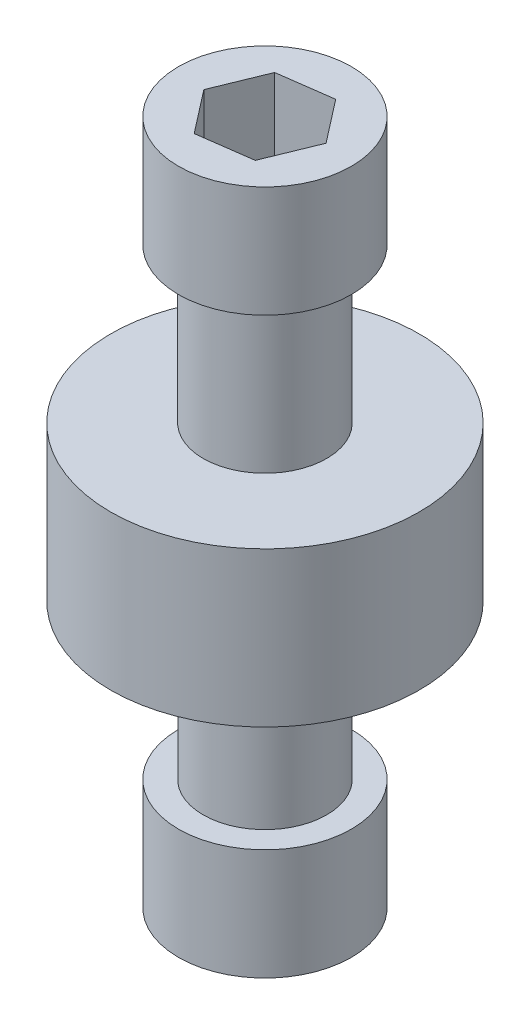
ISO-10303-21;
HEADER;
FILE_DESCRIPTION(('STEP AP214'),'2;1');
FILE_NAME('part.step','',(''),(''),'','','');
FILE_SCHEMA(('AUTOMOTIVE_DESIGN { 1 0 10303 214 1 1 1 1 }'));
ENDSEC;
DATA;
#1=APPLICATION_CONTEXT('core data for automotive mechanical design processes');
#2=APPLICATION_PROTOCOL_DEFINITION('international standard','automotive_design',2000,#1);
#3=PRODUCT_CONTEXT('',#1,'mechanical');
#4=PRODUCT('Part','Part','',(#3));
#5=PRODUCT_RELATED_PRODUCT_CATEGORY('part','',(#4));
#6=PRODUCT_DEFINITION_FORMATION('','',#4);
#7=PRODUCT_DEFINITION_CONTEXT('part definition',#1,'design');
#8=PRODUCT_DEFINITION('design','',#6,#7);
#9=PRODUCT_DEFINITION_SHAPE('','',#8);
#10=(LENGTH_UNIT() NAMED_UNIT(*) SI_UNIT(.MILLI.,.METRE.));
#11=(NAMED_UNIT(*) PLANE_ANGLE_UNIT() SI_UNIT($,.RADIAN.));
#12=(NAMED_UNIT(*) SI_UNIT($,.STERADIAN.) SOLID_ANGLE_UNIT());
#13=UNCERTAINTY_MEASURE_WITH_UNIT(LENGTH_MEASURE(1.E-05),#10,'distance_accuracy_value','');
#14=(GEOMETRIC_REPRESENTATION_CONTEXT(3) GLOBAL_UNCERTAINTY_ASSIGNED_CONTEXT((#13)) GLOBAL_UNIT_ASSIGNED_CONTEXT((#10,
#11,#12)) REPRESENTATION_CONTEXT('',''));
#15=CARTESIAN_POINT('',(0.,0.,0.));
#16=DIRECTION('',(0.,0.,1.));
#17=DIRECTION('',(1.,0.,0.));
#18=AXIS2_PLACEMENT_3D('',#15,#16,#17);
#19=CARTESIAN_POINT('',(0.,-10.922,0.));
#20=DIRECTION('',(0.,-1.,0.));
#21=DIRECTION('',(0.,0.,1.));
#22=AXIS2_PLACEMENT_3D('',#19,#20,#21);
#23=PLANE('',#22);
#24=CARTESIAN_POINT('',(0.,-10.922,0.));
#25=DIRECTION('',(0.,1.,0.));
#26=DIRECTION('',(0.,0.,1.));
#27=AXIS2_PLACEMENT_3D('',#24,#25,#26);
#28=CIRCLE('',#27,3.556);
#29=CARTESIAN_POINT('',(0.,-10.922,3.556));
#30=VERTEX_POINT('',#29);
#31=EDGE_CURVE('E215',#30,#30,#28,.T.);
#32=ORIENTED_EDGE('',*,*,#31,.F.);
#33=EDGE_LOOP('',(#32));
#34=FACE_BOUND('',#33,.T.);
#35=DIRECTION('',(0.990813388488827,0.,-0.135236197784794));
#36=VECTOR('',#35,1.);
#37=CARTESIAN_POINT('',(-0.844747720357736,-10.922,2.06713158503077));
#38=LINE('',#37,#36);
#39=CARTESIAN_POINT('',(-0.844747720357736,-10.922,2.06713158503077));
#40=VERTEX_POINT('',#39);
#41=CARTESIAN_POINT('',(1.36781460542297,-10.922,1.76513877813418));
#42=VERTEX_POINT('',#41);
#43=EDGE_CURVE('E189',#40,#42,#38,.T.);
#44=ORIENTED_EDGE('',*,*,#43,.T.);
#45=DIRECTION('',(0.378288711451565,0.,-0.925687663733462));
#46=VECTOR('',#45,1.);
#47=CARTESIAN_POINT('',(1.36781460542297,-10.922,1.76513877813418));
#48=LINE('',#47,#46);
#49=CARTESIAN_POINT('',(2.21256232578071,-10.922,-0.301992806896592));
#50=VERTEX_POINT('',#49);
#51=EDGE_CURVE('E56',#42,#50,#48,.T.);
#52=ORIENTED_EDGE('',*,*,#51,.T.);
#53=DIRECTION('',(-0.612524677037262,0.,-0.790451465948667));
#54=VECTOR('',#53,1.);
#55=CARTESIAN_POINT('',(2.21256232578071,-10.922,-0.301992806896592));
#56=LINE('',#55,#54);
#57=CARTESIAN_POINT('',(0.844747720357737,-10.922,-2.06713158503077));
#58=VERTEX_POINT('',#57);
#59=EDGE_CURVE('E171',#50,#58,#56,.T.);
#60=ORIENTED_EDGE('',*,*,#59,.T.);
#61=DIRECTION('',(-0.990813388488827,0.,0.135236197784794));
#62=VECTOR('',#61,1.);
#63=CARTESIAN_POINT('',(0.844747720357737,-10.922,-2.06713158503077));
#64=LINE('',#63,#62);
#65=CARTESIAN_POINT('',(-1.36781460542297,-10.922,-1.76513877813418));
#66=VERTEX_POINT('',#65);
#67=EDGE_CURVE('E175',#58,#66,#64,.T.);
#68=ORIENTED_EDGE('',*,*,#67,.T.);
#69=DIRECTION('',(-0.378288711451565,0.,0.925687663733461));
#70=VECTOR('',#69,1.);
#71=CARTESIAN_POINT('',(-1.36781460542297,-10.922,-1.76513877813418));
#72=LINE('',#71,#70);
#73=CARTESIAN_POINT('',(-2.21256232578071,-10.922,0.301992806896591));
#74=VERTEX_POINT('',#73);
#75=EDGE_CURVE('E195',#66,#74,#72,.T.);
#76=ORIENTED_EDGE('',*,*,#75,.T.);
#77=DIRECTION('',(0.612524677037262,0.,0.790451465948668));
#78=VECTOR('',#77,1.);
#79=CARTESIAN_POINT('',(-2.21256232578071,-10.922,0.301992806896591));
#80=LINE('',#79,#78);
#81=EDGE_CURVE('E192',#74,#40,#80,.T.);
#82=ORIENTED_EDGE('',*,*,#81,.T.);
#83=EDGE_LOOP('',(#44,#52,#60,#68,#76,#82));
#84=FACE_BOUND('',#83,.T.);
#85=ADVANCED_FACE('F38',(#34,#84),#23,.T.);
#86=CARTESIAN_POINT('',(0.,6.35,0.));
#87=DIRECTION('',(0.,-1.,0.));
#88=DIRECTION('',(0.,0.,-1.));
#89=AXIS2_PLACEMENT_3D('',#86,#87,#88);
#90=CYLINDRICAL_SURFACE('',#89,6.35);
#91=CARTESIAN_POINT('',(0.,6.35,0.));
#92=DIRECTION('',(0.,1.,0.));
#93=DIRECTION('',(0.,0.,1.));
#94=AXIS2_PLACEMENT_3D('',#91,#92,#93);
#95=CIRCLE('',#94,6.35);
#96=CARTESIAN_POINT('',(0.,6.35,6.35));
#97=VERTEX_POINT('',#96);
#98=EDGE_CURVE('E11',#97,#97,#95,.T.);
#99=ORIENTED_EDGE('',*,*,#98,.F.);
#100=EDGE_LOOP('',(#99));
#101=FACE_BOUND('',#100,.T.);
#102=CARTESIAN_POINT('',(0.,0.,0.));
#103=DIRECTION('',(0.,1.,0.));
#104=DIRECTION('',(0.,0.,1.));
#105=AXIS2_PLACEMENT_3D('',#102,#103,#104);
#106=CIRCLE('',#105,6.35);
#107=CARTESIAN_POINT('',(0.,0.,6.35));
#108=VERTEX_POINT('',#107);
#109=EDGE_CURVE('E42',#108,#108,#106,.T.);
#110=ORIENTED_EDGE('',*,*,#109,.T.);
#111=EDGE_LOOP('',(#110));
#112=FACE_BOUND('',#111,.T.);
#113=ADVANCED_FACE('F40',(#101,#112),#90,.T.);
#114=CARTESIAN_POINT('',(0.,6.35,0.));
#115=DIRECTION('',(0.,1.,0.));
#116=DIRECTION('',(0.,0.,1.));
#117=AXIS2_PLACEMENT_3D('',#114,#115,#116);
#118=PLANE('',#117);
#119=CARTESIAN_POINT('',(0.,6.35,0.));
#120=DIRECTION('',(0.,1.,0.));
#121=DIRECTION('',(0.,0.,1.));
#122=AXIS2_PLACEMENT_3D('',#119,#120,#121);
#123=CIRCLE('',#122,2.54);
#124=CARTESIAN_POINT('',(0.,6.35,2.54));
#125=VERTEX_POINT('',#124);
#126=EDGE_CURVE('E299',#125,#125,#123,.T.);
#127=ORIENTED_EDGE('',*,*,#126,.F.);
#128=EDGE_LOOP('',(#127));
#129=FACE_BOUND('',#128,.T.);
#130=ORIENTED_EDGE('',*,*,#98,.T.);
#131=EDGE_LOOP('',(#130));
#132=FACE_BOUND('',#131,.T.);
#133=ADVANCED_FACE('F313',(#129,#132),#118,.T.);
#134=CARTESIAN_POINT('',(0.,0.,0.));
#135=DIRECTION('',(0.,1.,0.));
#136=DIRECTION('',(0.,0.,1.));
#137=AXIS2_PLACEMENT_3D('',#134,#135,#136);
#138=PLANE('',#137);
#139=CARTESIAN_POINT('',(0.,0.,0.));
#140=DIRECTION('',(0.,1.,0.));
#141=DIRECTION('',(0.,0.,1.));
#142=AXIS2_PLACEMENT_3D('',#139,#140,#141);
#143=CIRCLE('',#142,2.54);
#144=CARTESIAN_POINT('',(0.,0.,2.54));
#145=VERTEX_POINT('',#144);
#146=EDGE_CURVE('E226',#145,#145,#143,.T.);
#147=ORIENTED_EDGE('',*,*,#146,.T.);
#148=EDGE_LOOP('',(#147));
#149=FACE_BOUND('',#148,.T.);
#150=ORIENTED_EDGE('',*,*,#109,.F.);
#151=EDGE_LOOP('',(#150));
#152=FACE_BOUND('',#151,.T.);
#153=ADVANCED_FACE('F316',(#149,#152),#138,.F.);
#154=CARTESIAN_POINT('',(0.,12.7,0.));
#155=DIRECTION('',(0.,-1.,0.));
#156=DIRECTION('',(0.,0.,-1.));
#157=AXIS2_PLACEMENT_3D('',#154,#155,#156);
#158=CYLINDRICAL_SURFACE('',#157,2.54);
#159=CARTESIAN_POINT('',(0.,12.7,0.));
#160=DIRECTION('',(0.,1.,0.));
#161=DIRECTION('',(0.,0.,1.));
#162=AXIS2_PLACEMENT_3D('',#159,#160,#161);
#163=CIRCLE('',#162,2.54);
#164=CARTESIAN_POINT('',(0.,12.7,2.54));
#165=VERTEX_POINT('',#164);
#166=EDGE_CURVE('E303',#165,#165,#163,.T.);
#167=ORIENTED_EDGE('',*,*,#166,.F.);
#168=EDGE_LOOP('',(#167));
#169=FACE_BOUND('',#168,.T.);
#170=ORIENTED_EDGE('',*,*,#126,.T.);
#171=EDGE_LOOP('',(#170));
#172=FACE_BOUND('',#171,.T.);
#173=ADVANCED_FACE('F311',(#169,#172),#158,.T.);
#174=CARTESIAN_POINT('',(0.,17.272,0.));
#175=DIRECTION('',(0.,-1.,0.));
#176=DIRECTION('',(0.,0.,-1.));
#177=AXIS2_PLACEMENT_3D('',#174,#175,#176);
#178=CYLINDRICAL_SURFACE('',#177,3.556);
#179=CARTESIAN_POINT('',(0.,17.272,0.));
#180=DIRECTION('',(0.,1.,0.));
#181=DIRECTION('',(0.,0.,1.));
#182=AXIS2_PLACEMENT_3D('',#179,#180,#181);
#183=CIRCLE('',#182,3.556);
#184=CARTESIAN_POINT('',(0.,17.272,3.556));
#185=VERTEX_POINT('',#184);
#186=EDGE_CURVE('E295',#185,#185,#183,.T.);
#187=ORIENTED_EDGE('',*,*,#186,.F.);
#188=EDGE_LOOP('',(#187));
#189=FACE_BOUND('',#188,.T.);
#190=CARTESIAN_POINT('',(0.,12.7,0.));
#191=DIRECTION('',(0.,1.,0.));
#192=DIRECTION('',(0.,0.,1.));
#193=AXIS2_PLACEMENT_3D('',#190,#191,#192);
#194=CIRCLE('',#193,3.556);
#195=CARTESIAN_POINT('',(0.,12.7,3.556));
#196=VERTEX_POINT('',#195);
#197=EDGE_CURVE('E280',#196,#196,#194,.T.);
#198=ORIENTED_EDGE('',*,*,#197,.T.);
#199=EDGE_LOOP('',(#198));
#200=FACE_BOUND('',#199,.T.);
#201=ADVANCED_FACE('F331',(#189,#200),#178,.T.);
#202=CARTESIAN_POINT('',(0.,17.272,0.));
#203=DIRECTION('',(0.,1.,0.));
#204=DIRECTION('',(0.,0.,1.));
#205=AXIS2_PLACEMENT_3D('',#202,#203,#204);
#206=PLANE('',#205);
#207=DIRECTION('',(0.378288711451565,0.,-0.925687663733462));
#208=VECTOR('',#207,1.);
#209=CARTESIAN_POINT('',(1.36781460542297,17.272,1.76513877813418));
#210=LINE('',#209,#208);
#211=CARTESIAN_POINT('',(1.36781460542297,17.272,1.76513877813418));
#212=VERTEX_POINT('',#211);
#213=CARTESIAN_POINT('',(2.21256232578071,17.272,-0.301992806896592));
#214=VERTEX_POINT('',#213);
#215=EDGE_CURVE('E67',#212,#214,#210,.T.);
#216=ORIENTED_EDGE('',*,*,#215,.F.);
#217=DIRECTION('',(0.990813388488827,0.,-0.135236197784794));
#218=VECTOR('',#217,1.);
#219=CARTESIAN_POINT('',(-0.844747720357736,17.272,2.06713158503077));
#220=LINE('',#219,#218);
#221=CARTESIAN_POINT('',(-0.844747720357736,17.272,2.06713158503077));
#222=VERTEX_POINT('',#221);
#223=EDGE_CURVE('E235',#222,#212,#220,.T.);
#224=ORIENTED_EDGE('',*,*,#223,.F.);
#225=DIRECTION('',(0.612524677037262,0.,0.790451465948668));
#226=VECTOR('',#225,1.);
#227=CARTESIAN_POINT('',(-2.21256232578071,17.272,0.301992806896591));
#228=LINE('',#227,#226);
#229=CARTESIAN_POINT('',(-2.21256232578071,17.272,0.301992806896591));
#230=VERTEX_POINT('',#229);
#231=EDGE_CURVE('E270',#230,#222,#228,.T.);
#232=ORIENTED_EDGE('',*,*,#231,.F.);
#233=DIRECTION('',(-0.378288711451565,0.,0.925687663733461));
#234=VECTOR('',#233,1.);
#235=CARTESIAN_POINT('',(-1.36781460542297,17.272,-1.76513877813418));
#236=LINE('',#235,#234);
#237=CARTESIAN_POINT('',(-1.36781460542297,17.272,-1.76513877813418));
#238=VERTEX_POINT('',#237);
#239=EDGE_CURVE('E266',#238,#230,#236,.T.);
#240=ORIENTED_EDGE('',*,*,#239,.F.);
#241=DIRECTION('',(-0.990813388488827,0.,0.135236197784794));
#242=VECTOR('',#241,1.);
#243=CARTESIAN_POINT('',(0.844747720357737,17.272,-2.06713158503077));
#244=LINE('',#243,#242);
#245=CARTESIAN_POINT('',(0.844747720357737,17.272,-2.06713158503077));
#246=VERTEX_POINT('',#245);
#247=EDGE_CURVE('E262',#246,#238,#244,.T.);
#248=ORIENTED_EDGE('',*,*,#247,.F.);
#249=DIRECTION('',(-0.612524677037262,0.,-0.790451465948667));
#250=VECTOR('',#249,1.);
#251=CARTESIAN_POINT('',(2.21256232578071,17.272,-0.301992806896592));
#252=LINE('',#251,#250);
#253=EDGE_CURVE('E258',#214,#246,#252,.T.);
#254=ORIENTED_EDGE('',*,*,#253,.F.);
#255=EDGE_LOOP('',(#216,#224,#232,#240,#248,#254));
#256=FACE_BOUND('',#255,.T.);
#257=ORIENTED_EDGE('',*,*,#186,.T.);
#258=EDGE_LOOP('',(#257));
#259=FACE_BOUND('',#258,.T.);
#260=ADVANCED_FACE('F384',(#256,#259),#206,.T.);
#261=CARTESIAN_POINT('',(0.,12.7,0.));
#262=DIRECTION('',(0.,1.,0.));
#263=DIRECTION('',(0.,0.,1.));
#264=AXIS2_PLACEMENT_3D('',#261,#262,#263);
#265=PLANE('',#264);
#266=ORIENTED_EDGE('',*,*,#166,.T.);
#267=EDGE_LOOP('',(#266));
#268=FACE_BOUND('',#267,.T.);
#269=ORIENTED_EDGE('',*,*,#197,.F.);
#270=EDGE_LOOP('',(#269));
#271=FACE_BOUND('',#270,.T.);
#272=ADVANCED_FACE('F383',(#268,#271),#265,.F.);
#273=CARTESIAN_POINT('',(1.36781460542297,13.716,1.76513877813418));
#274=DIRECTION('',(0.925687663733462,0.,0.378288711451565));
#275=DIRECTION('',(0.378288711451565,0.,-0.925687663733462));
#276=AXIS2_PLACEMENT_3D('',#273,#274,#275);
#277=PLANE('',#276);
#278=ORIENTED_EDGE('',*,*,#215,.T.);
#279=DIRECTION('',(0.,1.,0.));
#280=VECTOR('',#279,1.);
#281=CARTESIAN_POINT('',(2.21256232578071,13.716,-0.301992806896592));
#282=LINE('',#281,#280);
#283=CARTESIAN_POINT('',(2.21256232578071,13.716,-0.301992806896592));
#284=VERTEX_POINT('',#283);
#285=EDGE_CURVE('E255',#284,#214,#282,.T.);
#286=ORIENTED_EDGE('',*,*,#285,.F.);
#287=DIRECTION('',(0.378288711451565,0.,-0.925687663733462));
#288=VECTOR('',#287,1.);
#289=CARTESIAN_POINT('',(1.36781460542297,13.716,1.76513877813418));
#290=LINE('',#289,#288);
#291=CARTESIAN_POINT('',(1.36781460542297,13.716,1.76513877813418));
#292=VERTEX_POINT('',#291);
#293=EDGE_CURVE('E230',#292,#284,#290,.T.);
#294=ORIENTED_EDGE('',*,*,#293,.F.);
#295=DIRECTION('',(0.,1.,0.));
#296=VECTOR('',#295,1.);
#297=CARTESIAN_POINT('',(1.36781460542297,13.716,1.76513877813418));
#298=LINE('',#297,#296);
#299=EDGE_CURVE('E277',#292,#212,#298,.T.);
#300=ORIENTED_EDGE('',*,*,#299,.T.);
#301=EDGE_LOOP('',(#278,#286,#294,#300));
#302=FACE_BOUND('',#301,.T.);
#303=ADVANCED_FACE('F365',(#302),#277,.F.);
#304=CARTESIAN_POINT('',(-0.844747720357736,13.716,2.06713158503077));
#305=DIRECTION('',(0.135236197784794,0.,0.990813388488827));
#306=DIRECTION('',(0.990813388488827,0.,-0.135236197784794));
#307=AXIS2_PLACEMENT_3D('',#304,#305,#306);
#308=PLANE('',#307);
#309=ORIENTED_EDGE('',*,*,#223,.T.);
#310=ORIENTED_EDGE('',*,*,#299,.F.);
#311=DIRECTION('',(0.990813388488827,0.,-0.135236197784794));
#312=VECTOR('',#311,1.);
#313=CARTESIAN_POINT('',(-0.844747720357736,13.716,2.06713158503077));
#314=LINE('',#313,#312);
#315=CARTESIAN_POINT('',(-0.844747720357736,13.716,2.06713158503077));
#316=VERTEX_POINT('',#315);
#317=EDGE_CURVE('E251',#316,#292,#314,.T.);
#318=ORIENTED_EDGE('',*,*,#317,.F.);
#319=DIRECTION('',(0.,1.,0.));
#320=VECTOR('',#319,1.);
#321=CARTESIAN_POINT('',(-0.844747720357736,13.716,2.06713158503077));
#322=LINE('',#321,#320);
#323=EDGE_CURVE('E281',#316,#222,#322,.T.);
#324=ORIENTED_EDGE('',*,*,#323,.T.);
#325=EDGE_LOOP('',(#309,#310,#318,#324));
#326=FACE_BOUND('',#325,.T.);
#327=ADVANCED_FACE('F361',(#326),#308,.F.);
#328=CARTESIAN_POINT('',(-2.21256232578071,13.716,0.301992806896591));
#329=DIRECTION('',(-0.790451465948668,0.,0.612524677037262));
#330=DIRECTION('',(0.612524677037262,0.,0.790451465948668));
#331=AXIS2_PLACEMENT_3D('',#328,#329,#330);
#332=PLANE('',#331);
#333=ORIENTED_EDGE('',*,*,#231,.T.);
#334=ORIENTED_EDGE('',*,*,#323,.F.);
#335=DIRECTION('',(0.612524677037262,0.,0.790451465948668));
#336=VECTOR('',#335,1.);
#337=CARTESIAN_POINT('',(-2.21256232578071,13.716,0.301992806896591));
#338=LINE('',#337,#336);
#339=CARTESIAN_POINT('',(-2.21256232578071,13.716,0.301992806896591));
#340=VERTEX_POINT('',#339);
#341=EDGE_CURVE('E247',#340,#316,#338,.T.);
#342=ORIENTED_EDGE('',*,*,#341,.F.);
#343=DIRECTION('',(0.,1.,0.));
#344=VECTOR('',#343,1.);
#345=CARTESIAN_POINT('',(-2.21256232578071,13.716,0.301992806896591));
#346=LINE('',#345,#344);
#347=EDGE_CURVE('E284',#340,#230,#346,.T.);
#348=ORIENTED_EDGE('',*,*,#347,.T.);
#349=EDGE_LOOP('',(#333,#334,#342,#348));
#350=FACE_BOUND('',#349,.T.);
#351=ADVANCED_FACE('F364',(#350),#332,.F.);
#352=CARTESIAN_POINT('',(-1.36781460542297,13.716,-1.76513877813418));
#353=DIRECTION('',(-0.925687663733462,0.,-0.378288711451565));
#354=DIRECTION('',(-0.378288711451565,0.,0.925687663733462));
#355=AXIS2_PLACEMENT_3D('',#352,#353,#354);
#356=PLANE('',#355);
#357=ORIENTED_EDGE('',*,*,#239,.T.);
#358=ORIENTED_EDGE('',*,*,#347,.F.);
#359=DIRECTION('',(-0.378288711451565,0.,0.925687663733461));
#360=VECTOR('',#359,1.);
#361=CARTESIAN_POINT('',(-1.36781460542297,13.716,-1.76513877813418));
#362=LINE('',#361,#360);
#363=CARTESIAN_POINT('',(-1.36781460542297,13.716,-1.76513877813418));
#364=VERTEX_POINT('',#363);
#365=EDGE_CURVE('E243',#364,#340,#362,.T.);
#366=ORIENTED_EDGE('',*,*,#365,.F.);
#367=DIRECTION('',(0.,1.,0.));
#368=VECTOR('',#367,1.);
#369=CARTESIAN_POINT('',(-1.36781460542297,13.716,-1.76513877813418));
#370=LINE('',#369,#368);
#371=EDGE_CURVE('E287',#364,#238,#370,.T.);
#372=ORIENTED_EDGE('',*,*,#371,.T.);
#373=EDGE_LOOP('',(#357,#358,#366,#372));
#374=FACE_BOUND('',#373,.T.);
#375=ADVANCED_FACE('F369',(#374),#356,.F.);
#376=CARTESIAN_POINT('',(0.844747720357737,13.716,-2.06713158503077));
#377=DIRECTION('',(-0.135236197784794,0.,-0.990813388488827));
#378=DIRECTION('',(-0.990813388488827,0.,0.135236197784794));
#379=AXIS2_PLACEMENT_3D('',#376,#377,#378);
#380=PLANE('',#379);
#381=ORIENTED_EDGE('',*,*,#247,.T.);
#382=ORIENTED_EDGE('',*,*,#371,.F.);
#383=DIRECTION('',(-0.990813388488827,0.,0.135236197784794));
#384=VECTOR('',#383,1.);
#385=CARTESIAN_POINT('',(0.844747720357737,13.716,-2.06713158503077));
#386=LINE('',#385,#384);
#387=CARTESIAN_POINT('',(0.844747720357737,13.716,-2.06713158503077));
#388=VERTEX_POINT('',#387);
#389=EDGE_CURVE('E239',#388,#364,#386,.T.);
#390=ORIENTED_EDGE('',*,*,#389,.F.);
#391=DIRECTION('',(0.,1.,0.));
#392=VECTOR('',#391,1.);
#393=CARTESIAN_POINT('',(0.844747720357737,13.716,-2.06713158503077));
#394=LINE('',#393,#392);
#395=EDGE_CURVE('E290',#388,#246,#394,.T.);
#396=ORIENTED_EDGE('',*,*,#395,.T.);
#397=EDGE_LOOP('',(#381,#382,#390,#396));
#398=FACE_BOUND('',#397,.T.);
#399=ADVANCED_FACE('F373',(#398),#380,.F.);
#400=CARTESIAN_POINT('',(2.21256232578071,13.716,-0.301992806896592));
#401=DIRECTION('',(0.790451465948667,0.,-0.612524677037262));
#402=DIRECTION('',(-0.612524677037262,0.,-0.790451465948668));
#403=AXIS2_PLACEMENT_3D('',#400,#401,#402);
#404=PLANE('',#403);
#405=ORIENTED_EDGE('',*,*,#253,.T.);
#406=ORIENTED_EDGE('',*,*,#395,.F.);
#407=DIRECTION('',(-0.612524677037262,0.,-0.790451465948667));
#408=VECTOR('',#407,1.);
#409=CARTESIAN_POINT('',(2.21256232578071,13.716,-0.301992806896592));
#410=LINE('',#409,#408);
#411=EDGE_CURVE('E234',#284,#388,#410,.T.);
#412=ORIENTED_EDGE('',*,*,#411,.F.);
#413=ORIENTED_EDGE('',*,*,#285,.T.);
#414=EDGE_LOOP('',(#405,#406,#412,#413));
#415=FACE_BOUND('',#414,.T.);
#416=ADVANCED_FACE('F359',(#415),#404,.F.);
#417=CARTESIAN_POINT('',(0.,13.716,0.));
#418=DIRECTION('',(0.,1.,0.));
#419=DIRECTION('',(0.,0.,1.));
#420=AXIS2_PLACEMENT_3D('',#417,#418,#419);
#421=PLANE('',#420);
#422=ORIENTED_EDGE('',*,*,#293,.T.);
#423=ORIENTED_EDGE('',*,*,#411,.T.);
#424=ORIENTED_EDGE('',*,*,#389,.T.);
#425=ORIENTED_EDGE('',*,*,#365,.T.);
#426=ORIENTED_EDGE('',*,*,#341,.T.);
#427=ORIENTED_EDGE('',*,*,#317,.T.);
#428=EDGE_LOOP('',(#422,#423,#424,#425,#426,#427));
#429=FACE_BOUND('',#428,.T.);
#430=ADVANCED_FACE('F355',(#429),#421,.T.);
#431=CARTESIAN_POINT('',(0.,-6.35,0.));
#432=DIRECTION('',(0.,1.,0.));
#433=DIRECTION('',(0.,0.,1.));
#434=AXIS2_PLACEMENT_3D('',#431,#432,#433);
#435=CYLINDRICAL_SURFACE('',#434,2.54);
#436=CARTESIAN_POINT('',(0.,-6.35,0.));
#437=DIRECTION('',(0.,-1.,0.));
#438=DIRECTION('',(0.,0.,-1.));
#439=AXIS2_PLACEMENT_3D('',#436,#437,#438);
#440=CIRCLE('',#439,2.54);
#441=CARTESIAN_POINT('',(0.,-6.35,-2.54));
#442=VERTEX_POINT('',#441);
#443=EDGE_CURVE('E219',#442,#442,#440,.F.);
#444=ORIENTED_EDGE('',*,*,#443,.T.);
#445=EDGE_LOOP('',(#444));
#446=FACE_BOUND('',#445,.T.);
#447=ORIENTED_EDGE('',*,*,#146,.F.);
#448=EDGE_LOOP('',(#447));
#449=FACE_BOUND('',#448,.T.);
#450=ADVANCED_FACE('F351',(#446,#449),#435,.T.);
#451=CARTESIAN_POINT('',(0.,-10.922,0.));
#452=DIRECTION('',(0.,1.,0.));
#453=DIRECTION('',(0.,0.,1.));
#454=AXIS2_PLACEMENT_3D('',#451,#452,#453);
#455=CYLINDRICAL_SURFACE('',#454,3.556);
#456=ORIENTED_EDGE('',*,*,#31,.T.);
#457=EDGE_LOOP('',(#456));
#458=FACE_BOUND('',#457,.T.);
#459=CARTESIAN_POINT('',(0.,-6.35,0.));
#460=DIRECTION('',(0.,1.,0.));
#461=DIRECTION('',(0.,0.,1.));
#462=AXIS2_PLACEMENT_3D('',#459,#460,#461);
#463=CIRCLE('',#462,3.556);
#464=CARTESIAN_POINT('',(0.,-6.35,3.556));
#465=VERTEX_POINT('',#464);
#466=EDGE_CURVE('E203',#465,#465,#463,.T.);
#467=ORIENTED_EDGE('',*,*,#466,.F.);
#468=EDGE_LOOP('',(#467));
#469=FACE_BOUND('',#468,.T.);
#470=ADVANCED_FACE('F347',(#458,#469),#455,.T.);
#471=CARTESIAN_POINT('',(0.,-6.35,0.));
#472=DIRECTION('',(0.,-1.,0.));
#473=DIRECTION('',(0.,0.,1.));
#474=AXIS2_PLACEMENT_3D('',#471,#472,#473);
#475=PLANE('',#474);
#476=ORIENTED_EDGE('',*,*,#443,.F.);
#477=EDGE_LOOP('',(#476));
#478=FACE_BOUND('',#477,.T.);
#479=ORIENTED_EDGE('',*,*,#466,.T.);
#480=EDGE_LOOP('',(#479));
#481=FACE_BOUND('',#480,.T.);
#482=ADVANCED_FACE('F344',(#478,#481),#475,.F.);
#483=CARTESIAN_POINT('',(1.36781460542297,-7.366,1.76513877813418));
#484=DIRECTION('',(-0.925687663733462,0.,-0.378288711451565));
#485=DIRECTION('',(-0.378288711451565,0.,0.925687663733462));
#486=AXIS2_PLACEMENT_3D('',#483,#484,#485);
#487=PLANE('',#486);
#488=ORIENTED_EDGE('',*,*,#51,.F.);
#489=DIRECTION('',(0.,-1.,0.));
#490=VECTOR('',#489,1.);
#491=CARTESIAN_POINT('',(1.36781460542297,-7.366,1.76513877813418));
#492=LINE('',#491,#490);
#493=CARTESIAN_POINT('',(1.36781460542297,-7.366,1.76513877813418));
#494=VERTEX_POINT('',#493);
#495=EDGE_CURVE('E152',#494,#42,#492,.T.);
#496=ORIENTED_EDGE('',*,*,#495,.F.);
#497=DIRECTION('',(0.378288711451565,0.,-0.925687663733462));
#498=VECTOR('',#497,1.);
#499=CARTESIAN_POINT('',(1.36781460542297,-7.366,1.76513877813418));
#500=LINE('',#499,#498);
#501=CARTESIAN_POINT('',(2.21256232578071,-7.366,-0.301992806896592));
#502=VERTEX_POINT('',#501);
#503=EDGE_CURVE('E160',#494,#502,#500,.T.);
#504=ORIENTED_EDGE('',*,*,#503,.T.);
#505=DIRECTION('',(0.,-1.,0.));
#506=VECTOR('',#505,1.);
#507=CARTESIAN_POINT('',(2.21256232578071,-7.366,-0.301992806896592));
#508=LINE('',#507,#506);
#509=EDGE_CURVE('E200',#502,#50,#508,.T.);
#510=ORIENTED_EDGE('',*,*,#509,.T.);
#511=EDGE_LOOP('',(#488,#496,#504,#510));
#512=FACE_BOUND('',#511,.T.);
#513=ADVANCED_FACE('F163',(#512),#487,.T.);
#514=CARTESIAN_POINT('',(2.21256232578071,-7.366,-0.301992806896592));
#515=DIRECTION('',(-0.790451465948667,0.,0.612524677037262));
#516=DIRECTION('',(0.612524677037262,0.,0.790451465948668));
#517=AXIS2_PLACEMENT_3D('',#514,#515,#516);
#518=PLANE('',#517);
#519=ORIENTED_EDGE('',*,*,#59,.F.);
#520=ORIENTED_EDGE('',*,*,#509,.F.);
#521=DIRECTION('',(-0.612524677037262,0.,-0.790451465948667));
#522=VECTOR('',#521,1.);
#523=CARTESIAN_POINT('',(2.21256232578071,-7.366,-0.301992806896592));
#524=LINE('',#523,#522);
#525=CARTESIAN_POINT('',(0.844747720357737,-7.366,-2.06713158503077));
#526=VERTEX_POINT('',#525);
#527=EDGE_CURVE('E166',#502,#526,#524,.T.);
#528=ORIENTED_EDGE('',*,*,#527,.T.);
#529=DIRECTION('',(0.,-1.,0.));
#530=VECTOR('',#529,1.);
#531=CARTESIAN_POINT('',(0.844747720357737,-7.366,-2.06713158503077));
#532=LINE('',#531,#530);
#533=EDGE_CURVE('E204',#526,#58,#532,.T.);
#534=ORIENTED_EDGE('',*,*,#533,.T.);
#535=EDGE_LOOP('',(#519,#520,#528,#534));
#536=FACE_BOUND('',#535,.T.);
#537=ADVANCED_FACE('F457',(#536),#518,.T.);
#538=CARTESIAN_POINT('',(0.844747720357737,-7.366,-2.06713158503077));
#539=DIRECTION('',(0.135236197784794,0.,0.990813388488827));
#540=DIRECTION('',(0.990813388488827,0.,-0.135236197784794));
#541=AXIS2_PLACEMENT_3D('',#538,#539,#540);
#542=PLANE('',#541);
#543=ORIENTED_EDGE('',*,*,#67,.F.);
#544=ORIENTED_EDGE('',*,*,#533,.F.);
#545=DIRECTION('',(-0.990813388488827,0.,0.135236197784794));
#546=VECTOR('',#545,1.);
#547=CARTESIAN_POINT('',(0.844747720357737,-7.366,-2.06713158503077));
#548=LINE('',#547,#546);
#549=CARTESIAN_POINT('',(-1.36781460542297,-7.366,-1.76513877813418));
#550=VERTEX_POINT('',#549);
#551=EDGE_CURVE('E183',#526,#550,#548,.T.);
#552=ORIENTED_EDGE('',*,*,#551,.T.);
#553=DIRECTION('',(0.,-1.,0.));
#554=VECTOR('',#553,1.);
#555=CARTESIAN_POINT('',(-1.36781460542297,-7.366,-1.76513877813418));
#556=LINE('',#555,#554);
#557=EDGE_CURVE('E207',#550,#66,#556,.T.);
#558=ORIENTED_EDGE('',*,*,#557,.T.);
#559=EDGE_LOOP('',(#543,#544,#552,#558));
#560=FACE_BOUND('',#559,.T.);
#561=ADVANCED_FACE('F463',(#560),#542,.T.);
#562=CARTESIAN_POINT('',(-1.36781460542297,-7.366,-1.76513877813418));
#563=DIRECTION('',(0.925687663733462,0.,0.378288711451565));
#564=DIRECTION('',(0.378288711451565,0.,-0.925687663733462));
#565=AXIS2_PLACEMENT_3D('',#562,#563,#564);
#566=PLANE('',#565);
#567=ORIENTED_EDGE('',*,*,#75,.F.);
#568=ORIENTED_EDGE('',*,*,#557,.F.);
#569=DIRECTION('',(-0.378288711451565,0.,0.925687663733461));
#570=VECTOR('',#569,1.);
#571=CARTESIAN_POINT('',(-1.36781460542297,-7.366,-1.76513877813418));
#572=LINE('',#571,#570);
#573=CARTESIAN_POINT('',(-2.21256232578071,-7.366,0.301992806896591));
#574=VERTEX_POINT('',#573);
#575=EDGE_CURVE('E180',#550,#574,#572,.T.);
#576=ORIENTED_EDGE('',*,*,#575,.T.);
#577=DIRECTION('',(0.,-1.,0.));
#578=VECTOR('',#577,1.);
#579=CARTESIAN_POINT('',(-2.21256232578071,-7.366,0.301992806896591));
#580=LINE('',#579,#578);
#581=EDGE_CURVE('E210',#574,#74,#580,.T.);
#582=ORIENTED_EDGE('',*,*,#581,.T.);
#583=EDGE_LOOP('',(#567,#568,#576,#582));
#584=FACE_BOUND('',#583,.T.);
#585=ADVANCED_FACE('F471',(#584),#566,.T.);
#586=CARTESIAN_POINT('',(-2.21256232578071,-7.366,0.301992806896591));
#587=DIRECTION('',(0.790451465948668,0.,-0.612524677037262));
#588=DIRECTION('',(-0.612524677037262,0.,-0.790451465948668));
#589=AXIS2_PLACEMENT_3D('',#586,#587,#588);
#590=PLANE('',#589);
#591=ORIENTED_EDGE('',*,*,#81,.F.);
#592=ORIENTED_EDGE('',*,*,#581,.F.);
#593=DIRECTION('',(0.612524677037262,0.,0.790451465948668));
#594=VECTOR('',#593,1.);
#595=CARTESIAN_POINT('',(-2.21256232578071,-7.366,0.301992806896591));
#596=LINE('',#595,#594);
#597=CARTESIAN_POINT('',(-0.844747720357736,-7.366,2.06713158503077));
#598=VERTEX_POINT('',#597);
#599=EDGE_CURVE('E159',#574,#598,#596,.T.);
#600=ORIENTED_EDGE('',*,*,#599,.T.);
#601=DIRECTION('',(0.,-1.,0.));
#602=VECTOR('',#601,1.);
#603=CARTESIAN_POINT('',(-0.844747720357736,-7.366,2.06713158503077));
#604=LINE('',#603,#602);
#605=EDGE_CURVE('E154',#598,#40,#604,.T.);
#606=ORIENTED_EDGE('',*,*,#605,.T.);
#607=EDGE_LOOP('',(#591,#592,#600,#606));
#608=FACE_BOUND('',#607,.T.);
#609=ADVANCED_FACE('F479',(#608),#590,.T.);
#610=CARTESIAN_POINT('',(-0.844747720357736,-7.366,2.06713158503077));
#611=DIRECTION('',(-0.135236197784794,0.,-0.990813388488827));
#612=DIRECTION('',(-0.990813388488827,0.,0.135236197784794));
#613=AXIS2_PLACEMENT_3D('',#610,#611,#612);
#614=PLANE('',#613);
#615=ORIENTED_EDGE('',*,*,#43,.F.);
#616=ORIENTED_EDGE('',*,*,#605,.F.);
#617=DIRECTION('',(0.990813388488827,0.,-0.135236197784794));
#618=VECTOR('',#617,1.);
#619=CARTESIAN_POINT('',(-0.844747720357736,-7.366,2.06713158503077));
#620=LINE('',#619,#618);
#621=EDGE_CURVE('E149',#598,#494,#620,.T.);
#622=ORIENTED_EDGE('',*,*,#621,.T.);
#623=ORIENTED_EDGE('',*,*,#495,.T.);
#624=EDGE_LOOP('',(#615,#616,#622,#623));
#625=FACE_BOUND('',#624,.T.);
#626=ADVANCED_FACE('F151',(#625),#614,.T.);
#627=CARTESIAN_POINT('',(0.,-7.366,0.));
#628=DIRECTION('',(0.,-1.,0.));
#629=DIRECTION('',(0.,0.,1.));
#630=AXIS2_PLACEMENT_3D('',#627,#628,#629);
#631=PLANE('',#630);
#632=ORIENTED_EDGE('',*,*,#503,.F.);
#633=ORIENTED_EDGE('',*,*,#621,.F.);
#634=ORIENTED_EDGE('',*,*,#599,.F.);
#635=ORIENTED_EDGE('',*,*,#575,.F.);
#636=ORIENTED_EDGE('',*,*,#551,.F.);
#637=ORIENTED_EDGE('',*,*,#527,.F.);
#638=EDGE_LOOP('',(#632,#633,#634,#635,#636,#637));
#639=FACE_BOUND('',#638,.T.);
#640=ADVANCED_FACE('F168',(#639),#631,.T.);
#641=CLOSED_SHELL('',(#85,#113,#133,#153,#173,#201,#260,#272,#303,#327,#351,#375,#399,#416,#430,
#450,#470,#482,#513,#537,#561,#585,#609,#626,#640));
#642=MANIFOLD_SOLID_BREP('B2',#641);
#643=ADVANCED_BREP_SHAPE_REPRESENTATION('',(#18,#642),#14);
#644=SHAPE_DEFINITION_REPRESENTATION(#9,#643);
ENDSEC;
END-ISO-10303-21;
